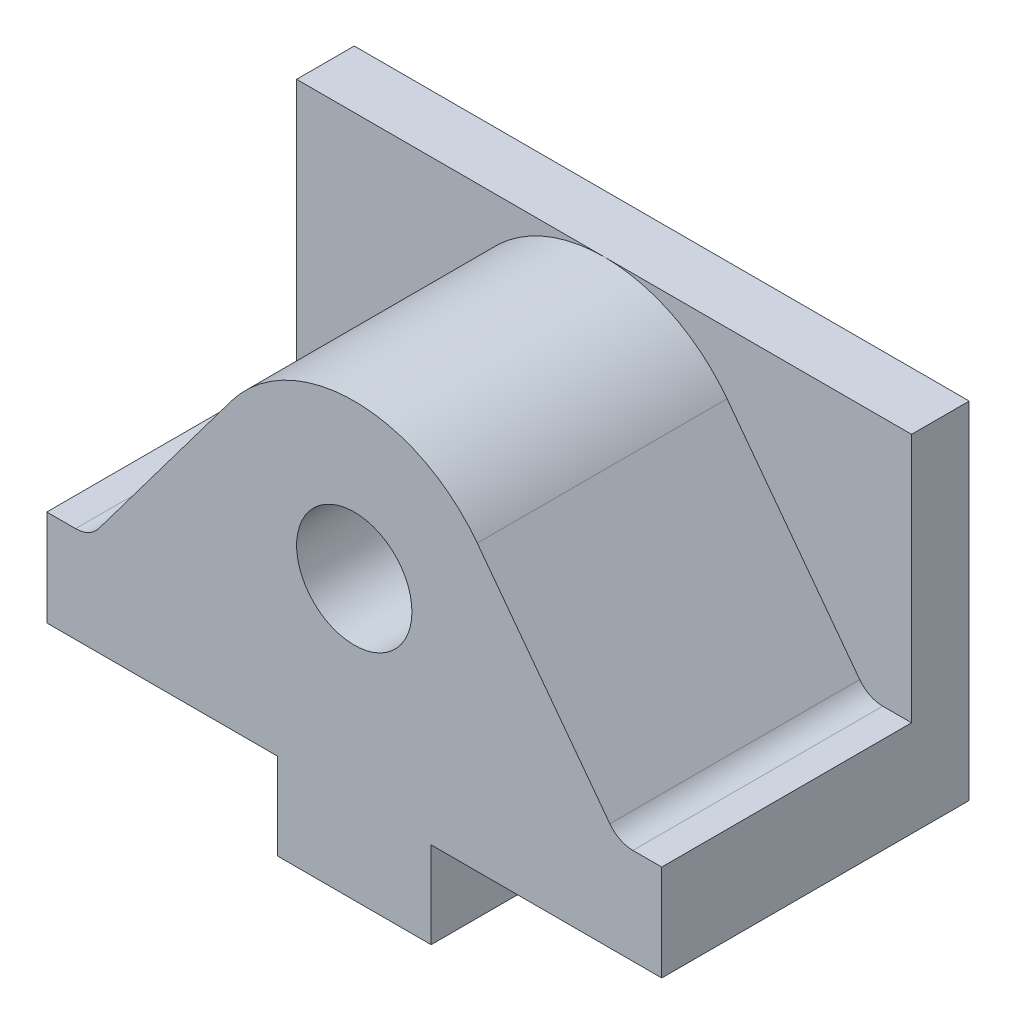
ISO-10303-21;
HEADER;
FILE_DESCRIPTION(('STEP AP214'),'2;1');
FILE_NAME('part.step','',(''),(''),'','','');
FILE_SCHEMA(('AUTOMOTIVE_DESIGN { 1 0 10303 214 1 1 1 1 }'));
ENDSEC;
DATA;
#1=APPLICATION_CONTEXT('core data for automotive mechanical design processes');
#2=APPLICATION_PROTOCOL_DEFINITION('international standard','automotive_design',2000,#1);
#3=PRODUCT_CONTEXT('',#1,'mechanical');
#4=PRODUCT('Part','Part','',(#3));
#5=PRODUCT_RELATED_PRODUCT_CATEGORY('part','',(#4));
#6=PRODUCT_DEFINITION_FORMATION('','',#4);
#7=PRODUCT_DEFINITION_CONTEXT('part definition',#1,'design');
#8=PRODUCT_DEFINITION('design','',#6,#7);
#9=PRODUCT_DEFINITION_SHAPE('','',#8);
#10=(LENGTH_UNIT() NAMED_UNIT(*) SI_UNIT(.MILLI.,.METRE.));
#11=(NAMED_UNIT(*) PLANE_ANGLE_UNIT() SI_UNIT($,.RADIAN.));
#12=(NAMED_UNIT(*) SI_UNIT($,.STERADIAN.) SOLID_ANGLE_UNIT());
#13=UNCERTAINTY_MEASURE_WITH_UNIT(LENGTH_MEASURE(1.E-05),#10,'distance_accuracy_value','');
#14=(GEOMETRIC_REPRESENTATION_CONTEXT(3) GLOBAL_UNCERTAINTY_ASSIGNED_CONTEXT((#13)) GLOBAL_UNIT_ASSIGNED_CONTEXT((#10,
#11,#12)) REPRESENTATION_CONTEXT('',''));
#15=CARTESIAN_POINT('',(0.,0.,0.));
#16=DIRECTION('',(0.,0.,1.));
#17=DIRECTION('',(1.,0.,0.));
#18=AXIS2_PLACEMENT_3D('',#15,#16,#17);
#19=CARTESIAN_POINT('',(0.,0.,0.));
#20=DIRECTION('',(0.,1.,0.));
#21=DIRECTION('',(0.,0.,1.));
#22=AXIS2_PLACEMENT_3D('',#19,#20,#21);
#23=PLANE('',#22);
#24=DIRECTION('',(0.,0.,1.));
#25=VECTOR('',#24,1.);
#26=CARTESIAN_POINT('',(8.,0.,16.));
#27=LINE('',#26,#25);
#28=CARTESIAN_POINT('',(8.,0.,-16.));
#29=VERTEX_POINT('',#28);
#30=CARTESIAN_POINT('',(8.,0.,16.));
#31=VERTEX_POINT('',#30);
#32=EDGE_CURVE('E126',#29,#31,#27,.T.);
#33=ORIENTED_EDGE('',*,*,#32,.F.);
#34=DIRECTION('',(-1.,0.,0.));
#35=VECTOR('',#34,1.);
#36=CARTESIAN_POINT('',(-32.,0.,-16.));
#37=LINE('',#36,#35);
#38=CARTESIAN_POINT('',(32.,0.,-16.));
#39=VERTEX_POINT('',#38);
#40=EDGE_CURVE('E341',#39,#29,#37,.T.);
#41=ORIENTED_EDGE('',*,*,#40,.F.);
#42=DIRECTION('',(0.,0.,-1.));
#43=VECTOR('',#42,1.);
#44=CARTESIAN_POINT('',(32.,0.,-16.));
#45=LINE('',#44,#43);
#46=CARTESIAN_POINT('',(32.,0.,16.));
#47=VERTEX_POINT('',#46);
#48=EDGE_CURVE('E324',#47,#39,#45,.T.);
#49=ORIENTED_EDGE('',*,*,#48,.F.);
#50=DIRECTION('',(1.,0.,0.));
#51=VECTOR('',#50,1.);
#52=CARTESIAN_POINT('',(-32.,0.,16.));
#53=LINE('',#52,#51);
#54=EDGE_CURVE('E131',#31,#47,#53,.T.);
#55=ORIENTED_EDGE('',*,*,#54,.F.);
#56=EDGE_LOOP('',(#33,#41,#49,#55));
#57=FACE_BOUND('',#56,.T.);
#58=ADVANCED_FACE('F110',(#57),#23,.F.);
#59=DIRECTION('',(0.,0.,-1.));
#60=VECTOR('',#59,1.);
#61=CARTESIAN_POINT('',(-8.,0.,16.));
#62=LINE('',#61,#60);
#63=CARTESIAN_POINT('',(-8.,0.,16.));
#64=VERTEX_POINT('',#63);
#65=CARTESIAN_POINT('',(-8.,0.,-16.));
#66=VERTEX_POINT('',#65);
#67=EDGE_CURVE('E363',#64,#66,#62,.T.);
#68=ORIENTED_EDGE('',*,*,#67,.F.);
#69=CARTESIAN_POINT('',(-32.,0.,16.));
#70=VERTEX_POINT('',#69);
#71=EDGE_CURVE('E250',#70,#64,#53,.T.);
#72=ORIENTED_EDGE('',*,*,#71,.F.);
#73=DIRECTION('',(0.,0.,1.));
#74=VECTOR('',#73,1.);
#75=CARTESIAN_POINT('',(-32.,0.,-16.));
#76=LINE('',#75,#74);
#77=CARTESIAN_POINT('',(-32.,0.,-16.));
#78=VERTEX_POINT('',#77);
#79=EDGE_CURVE('E343',#78,#70,#76,.T.);
#80=ORIENTED_EDGE('',*,*,#79,.F.);
#81=EDGE_CURVE('E340',#66,#78,#37,.T.);
#82=ORIENTED_EDGE('',*,*,#81,.F.);
#83=EDGE_LOOP('',(#68,#72,#80,#82));
#84=FACE_BOUND('',#83,.T.);
#85=ADVANCED_FACE('F362',(#84),#23,.F.);
#86=CARTESIAN_POINT('',(0.,36.,0.));
#87=DIRECTION('',(0.,1.,0.));
#88=DIRECTION('',(0.,0.,1.));
#89=AXIS2_PLACEMENT_3D('',#86,#87,#88);
#90=PLANE('',#89);
#91=DIRECTION('',(-1.,0.,0.));
#92=VECTOR('',#91,1.);
#93=CARTESIAN_POINT('',(0.,36.,-10.));
#94=LINE('',#93,#92);
#95=CARTESIAN_POINT('',(0.,36.,-10.));
#96=VERTEX_POINT('',#95);
#97=CARTESIAN_POINT('',(-32.,36.,-10.));
#98=VERTEX_POINT('',#97);
#99=EDGE_CURVE('E306',#96,#98,#94,.T.);
#100=ORIENTED_EDGE('',*,*,#99,.F.);
#101=DIRECTION('',(-1.,0.,0.));
#102=VECTOR('',#101,1.);
#103=CARTESIAN_POINT('',(0.,36.,-10.));
#104=LINE('',#103,#102);
#105=CARTESIAN_POINT('',(32.,36.,-10.));
#106=VERTEX_POINT('',#105);
#107=EDGE_CURVE('E266',#106,#96,#104,.T.);
#108=ORIENTED_EDGE('',*,*,#107,.F.);
#109=DIRECTION('',(0.,0.,-1.));
#110=VECTOR('',#109,1.);
#111=CARTESIAN_POINT('',(32.,36.,-16.));
#112=LINE('',#111,#110);
#113=CARTESIAN_POINT('',(32.,36.,-16.));
#114=VERTEX_POINT('',#113);
#115=EDGE_CURVE('E330',#106,#114,#112,.T.);
#116=ORIENTED_EDGE('',*,*,#115,.T.);
#117=DIRECTION('',(-1.,0.,0.));
#118=VECTOR('',#117,1.);
#119=CARTESIAN_POINT('',(-32.,36.,-16.));
#120=LINE('',#119,#118);
#121=CARTESIAN_POINT('',(-32.,36.,-16.));
#122=VERTEX_POINT('',#121);
#123=EDGE_CURVE('E332',#114,#122,#120,.T.);
#124=ORIENTED_EDGE('',*,*,#123,.T.);
#125=DIRECTION('',(0.,0.,1.));
#126=VECTOR('',#125,1.);
#127=CARTESIAN_POINT('',(-32.,36.,-16.));
#128=LINE('',#127,#126);
#129=EDGE_CURVE('E334',#122,#98,#128,.T.);
#130=ORIENTED_EDGE('',*,*,#129,.T.);
#131=EDGE_LOOP('',(#100,#108,#116,#124,#130));
#132=FACE_BOUND('',#131,.T.);
#133=ADVANCED_FACE('F414',(#132),#90,.T.);
#134=CARTESIAN_POINT('',(32.,36.,-16.));
#135=DIRECTION('',(-1.,0.,0.));
#136=DIRECTION('',(0.,0.,1.));
#137=AXIS2_PLACEMENT_3D('',#134,#135,#136);
#138=PLANE('',#137);
#139=DIRECTION('',(0.,0.,1.));
#140=VECTOR('',#139,1.);
#141=CARTESIAN_POINT('',(32.,10.,-10.));
#142=LINE('',#141,#140);
#143=CARTESIAN_POINT('',(32.,10.,-10.));
#144=VERTEX_POINT('',#143);
#145=CARTESIAN_POINT('',(32.,10.,16.));
#146=VERTEX_POINT('',#145);
#147=EDGE_CURVE('E287',#144,#146,#142,.T.);
#148=ORIENTED_EDGE('',*,*,#147,.T.);
#149=DIRECTION('',(0.,-1.,0.));
#150=VECTOR('',#149,1.);
#151=CARTESIAN_POINT('',(32.,36.,16.));
#152=LINE('',#151,#150);
#153=EDGE_CURVE('E337',#146,#47,#152,.T.);
#154=ORIENTED_EDGE('',*,*,#153,.T.);
#155=ORIENTED_EDGE('',*,*,#48,.T.);
#156=DIRECTION('',(0.,-1.,0.));
#157=VECTOR('',#156,1.);
#158=CARTESIAN_POINT('',(32.,36.,-16.));
#159=LINE('',#158,#157);
#160=EDGE_CURVE('E12',#114,#39,#159,.T.);
#161=ORIENTED_EDGE('',*,*,#160,.F.);
#162=ORIENTED_EDGE('',*,*,#115,.F.);
#163=DIRECTION('',(0.,1.,0.));
#164=VECTOR('',#163,1.);
#165=CARTESIAN_POINT('',(32.,0.,-10.));
#166=LINE('',#165,#164);
#167=EDGE_CURVE('E264',#144,#106,#166,.T.);
#168=ORIENTED_EDGE('',*,*,#167,.F.);
#169=EDGE_LOOP('',(#148,#154,#155,#161,#162,#168));
#170=FACE_BOUND('',#169,.T.);
#171=ADVANCED_FACE('F112',(#170),#138,.F.);
#172=CARTESIAN_POINT('',(-32.,36.,16.));
#173=DIRECTION('',(0.,0.,-1.));
#174=DIRECTION('',(-1.,0.,0.));
#175=AXIS2_PLACEMENT_3D('',#172,#173,#174);
#176=PLANE('',#175);
#177=CARTESIAN_POINT('',(0.,20.,16.));
#178=DIRECTION('',(0.,0.,1.));
#179=DIRECTION('',(1.,0.,0.));
#180=AXIS2_PLACEMENT_3D('',#177,#178,#179);
#181=CIRCLE('',#180,6.);
#182=CARTESIAN_POINT('',(6.,20.,16.));
#183=VERTEX_POINT('',#182);
#184=EDGE_CURVE('E283',#183,#183,#181,.T.);
#185=ORIENTED_EDGE('',*,*,#184,.F.);
#186=EDGE_LOOP('',(#185));
#187=FACE_BOUND('',#186,.T.);
#188=DIRECTION('',(-0.6,0.8,0.));
#189=VECTOR('',#188,1.);
#190=CARTESIAN_POINT('',(22.4,16.8,16.));
#191=LINE('',#190,#189);
#192=CARTESIAN_POINT('',(26.6,11.2,16.));
#193=VERTEX_POINT('',#192);
#194=CARTESIAN_POINT('',(12.8,29.6,16.));
#195=VERTEX_POINT('',#194);
#196=EDGE_CURVE('E262',#193,#195,#191,.T.);
#197=ORIENTED_EDGE('',*,*,#196,.T.);
#198=CARTESIAN_POINT('',(0.,20.,16.));
#199=DIRECTION('',(0.,0.,1.));
#200=DIRECTION('',(1.,0.,0.));
#201=AXIS2_PLACEMENT_3D('',#198,#199,#200);
#202=CIRCLE('',#201,16.);
#203=CARTESIAN_POINT('',(-12.8,29.6,16.));
#204=VERTEX_POINT('',#203);
#205=EDGE_CURVE('E298',#195,#204,#202,.T.);
#206=ORIENTED_EDGE('',*,*,#205,.T.);
#207=DIRECTION('',(0.6,0.8,0.));
#208=VECTOR('',#207,1.);
#209=CARTESIAN_POINT('',(-22.4,16.8,16.));
#210=LINE('',#209,#208);
#211=CARTESIAN_POINT('',(-26.6,11.2,16.));
#212=VERTEX_POINT('',#211);
#213=EDGE_CURVE('E317',#212,#204,#210,.T.);
#214=ORIENTED_EDGE('',*,*,#213,.F.);
#215=CARTESIAN_POINT('',(-29.,13.,16.));
#216=DIRECTION('',(0.,0.,1.));
#217=DIRECTION('',(1.,0.,0.));
#218=AXIS2_PLACEMENT_3D('',#215,#216,#217);
#219=CIRCLE('',#218,3.);
#220=CARTESIAN_POINT('',(-29.,10.,16.));
#221=VERTEX_POINT('',#220);
#222=EDGE_CURVE('E314',#221,#212,#219,.T.);
#223=ORIENTED_EDGE('',*,*,#222,.F.);
#224=DIRECTION('',(1.,0.,0.));
#225=VECTOR('',#224,1.);
#226=CARTESIAN_POINT('',(0.,10.,16.));
#227=LINE('',#226,#225);
#228=CARTESIAN_POINT('',(-32.,10.,16.));
#229=VERTEX_POINT('',#228);
#230=EDGE_CURVE('E293',#229,#221,#227,.T.);
#231=ORIENTED_EDGE('',*,*,#230,.F.);
#232=DIRECTION('',(0.,-1.,0.));
#233=VECTOR('',#232,1.);
#234=CARTESIAN_POINT('',(-32.,36.,16.));
#235=LINE('',#234,#233);
#236=EDGE_CURVE('E349',#229,#70,#235,.T.);
#237=ORIENTED_EDGE('',*,*,#236,.T.);
#238=ORIENTED_EDGE('',*,*,#71,.T.);
#239=DIRECTION('',(0.,1.,0.));
#240=VECTOR('',#239,1.);
#241=CARTESIAN_POINT('',(-8.,-9.,16.));
#242=LINE('',#241,#240);
#243=CARTESIAN_POINT('',(-8.,-9.,16.));
#244=VERTEX_POINT('',#243);
#245=EDGE_CURVE('E230',#244,#64,#242,.T.);
#246=ORIENTED_EDGE('',*,*,#245,.F.);
#247=DIRECTION('',(-1.,0.,0.));
#248=VECTOR('',#247,1.);
#249=CARTESIAN_POINT('',(-8.,-9.,16.));
#250=LINE('',#249,#248);
#251=CARTESIAN_POINT('',(8.,-9.,16.));
#252=VERTEX_POINT('',#251);
#253=EDGE_CURVE('E236',#252,#244,#250,.T.);
#254=ORIENTED_EDGE('',*,*,#253,.F.);
#255=DIRECTION('',(0.,1.,0.));
#256=VECTOR('',#255,1.);
#257=CARTESIAN_POINT('',(8.,-9.,16.));
#258=LINE('',#257,#256);
#259=EDGE_CURVE('E369',#252,#31,#258,.T.);
#260=ORIENTED_EDGE('',*,*,#259,.T.);
#261=ORIENTED_EDGE('',*,*,#54,.T.);
#262=ORIENTED_EDGE('',*,*,#153,.F.);
#263=DIRECTION('',(-1.,0.,0.));
#264=VECTOR('',#263,1.);
#265=CARTESIAN_POINT('',(0.,10.,16.));
#266=LINE('',#265,#264);
#267=CARTESIAN_POINT('',(29.,10.,16.));
#268=VERTEX_POINT('',#267);
#269=EDGE_CURVE('E276',#146,#268,#266,.T.);
#270=ORIENTED_EDGE('',*,*,#269,.T.);
#271=CARTESIAN_POINT('',(29.,13.,16.));
#272=DIRECTION('',(0.,0.,1.));
#273=DIRECTION('',(1.,0.,0.));
#274=AXIS2_PLACEMENT_3D('',#271,#272,#273);
#275=CIRCLE('',#274,3.);
#276=EDGE_CURVE('E253',#268,#193,#275,.F.);
#277=ORIENTED_EDGE('',*,*,#276,.T.);
#278=EDGE_LOOP('',(#197,#206,#214,#223,#231,#237,#238,#246,#254,#260,#261,#262,#270,#277));
#279=FACE_BOUND('',#278,.T.);
#280=ADVANCED_FACE('F248',(#187,#279),#176,.F.);
#281=CARTESIAN_POINT('',(-32.,36.,-16.));
#282=DIRECTION('',(0.,0.,1.));
#283=DIRECTION('',(1.,0.,0.));
#284=AXIS2_PLACEMENT_3D('',#281,#282,#283);
#285=PLANE('',#284);
#286=CARTESIAN_POINT('',(0.,20.,-16.));
#287=DIRECTION('',(0.,0.,1.));
#288=DIRECTION('',(1.,0.,0.));
#289=AXIS2_PLACEMENT_3D('',#286,#287,#288);
#290=CIRCLE('',#289,6.);
#291=CARTESIAN_POINT('',(6.,20.,-16.));
#292=VERTEX_POINT('',#291);
#293=EDGE_CURVE('E114',#292,#292,#290,.T.);
#294=ORIENTED_EDGE('',*,*,#293,.T.);
#295=EDGE_LOOP('',(#294));
#296=FACE_BOUND('',#295,.T.);
#297=ORIENTED_EDGE('',*,*,#40,.T.);
#298=DIRECTION('',(0.,1.,0.));
#299=VECTOR('',#298,1.);
#300=CARTESIAN_POINT('',(8.,-9.,-16.));
#301=LINE('',#300,#299);
#302=CARTESIAN_POINT('',(8.,-9.,-16.));
#303=VERTEX_POINT('',#302);
#304=EDGE_CURVE('E254',#303,#29,#301,.T.);
#305=ORIENTED_EDGE('',*,*,#304,.F.);
#306=DIRECTION('',(1.,0.,0.));
#307=VECTOR('',#306,1.);
#308=CARTESIAN_POINT('',(-8.,-9.,-16.));
#309=LINE('',#308,#307);
#310=CARTESIAN_POINT('',(-8.,-9.,-16.));
#311=VERTEX_POINT('',#310);
#312=EDGE_CURVE('E235',#311,#303,#309,.T.);
#313=ORIENTED_EDGE('',*,*,#312,.F.);
#314=DIRECTION('',(0.,1.,0.));
#315=VECTOR('',#314,1.);
#316=CARTESIAN_POINT('',(-8.,-9.,-16.));
#317=LINE('',#316,#315);
#318=EDGE_CURVE('E232',#311,#66,#317,.T.);
#319=ORIENTED_EDGE('',*,*,#318,.T.);
#320=ORIENTED_EDGE('',*,*,#81,.T.);
#321=DIRECTION('',(0.,-1.,0.));
#322=VECTOR('',#321,1.);
#323=CARTESIAN_POINT('',(-32.,36.,-16.));
#324=LINE('',#323,#322);
#325=EDGE_CURVE('E119',#122,#78,#324,.T.);
#326=ORIENTED_EDGE('',*,*,#325,.F.);
#327=ORIENTED_EDGE('',*,*,#123,.F.);
#328=ORIENTED_EDGE('',*,*,#160,.T.);
#329=EDGE_LOOP('',(#297,#305,#313,#319,#320,#326,#327,#328));
#330=FACE_BOUND('',#329,.T.);
#331=ADVANCED_FACE('F374',(#296,#330),#285,.F.);
#332=CARTESIAN_POINT('',(-32.,36.,-16.));
#333=DIRECTION('',(1.,0.,0.));
#334=DIRECTION('',(0.,0.,-1.));
#335=AXIS2_PLACEMENT_3D('',#332,#333,#334);
#336=PLANE('',#335);
#337=ORIENTED_EDGE('',*,*,#236,.F.);
#338=DIRECTION('',(0.,0.,1.));
#339=VECTOR('',#338,1.);
#340=CARTESIAN_POINT('',(-32.,10.,-10.));
#341=LINE('',#340,#339);
#342=CARTESIAN_POINT('',(-32.,10.,-10.));
#343=VERTEX_POINT('',#342);
#344=EDGE_CURVE('E322',#343,#229,#341,.T.);
#345=ORIENTED_EDGE('',*,*,#344,.F.);
#346=DIRECTION('',(0.,-1.,0.));
#347=VECTOR('',#346,1.);
#348=CARTESIAN_POINT('',(-32.,0.,-10.));
#349=LINE('',#348,#347);
#350=EDGE_CURVE('E308',#98,#343,#349,.T.);
#351=ORIENTED_EDGE('',*,*,#350,.F.);
#352=ORIENTED_EDGE('',*,*,#129,.F.);
#353=ORIENTED_EDGE('',*,*,#325,.T.);
#354=ORIENTED_EDGE('',*,*,#79,.T.);
#355=EDGE_LOOP('',(#337,#345,#351,#352,#353,#354));
#356=FACE_BOUND('',#355,.T.);
#357=ADVANCED_FACE('F357',(#356),#336,.F.);
#358=CARTESIAN_POINT('',(0.,10.,-10.));
#359=DIRECTION('',(0.,-1.,0.));
#360=DIRECTION('',(0.,0.,-1.));
#361=AXIS2_PLACEMENT_3D('',#358,#359,#360);
#362=PLANE('',#361);
#363=ORIENTED_EDGE('',*,*,#230,.T.);
#364=DIRECTION('',(0.,0.,1.));
#365=VECTOR('',#364,1.);
#366=CARTESIAN_POINT('',(-29.,10.,-10.));
#367=LINE('',#366,#365);
#368=CARTESIAN_POINT('',(-29.,10.,-10.));
#369=VERTEX_POINT('',#368);
#370=EDGE_CURVE('E311',#369,#221,#367,.T.);
#371=ORIENTED_EDGE('',*,*,#370,.F.);
#372=DIRECTION('',(1.,0.,0.));
#373=VECTOR('',#372,1.);
#374=CARTESIAN_POINT('',(0.,10.,-10.));
#375=LINE('',#374,#373);
#376=EDGE_CURVE('E294',#343,#369,#375,.T.);
#377=ORIENTED_EDGE('',*,*,#376,.F.);
#378=ORIENTED_EDGE('',*,*,#344,.T.);
#379=EDGE_LOOP('',(#363,#371,#377,#378));
#380=FACE_BOUND('',#379,.T.);
#381=ADVANCED_FACE('F408',(#380),#362,.F.);
#382=CARTESIAN_POINT('',(0.,20.,-10.));
#383=DIRECTION('',(0.,0.,1.));
#384=DIRECTION('',(1.,0.,0.));
#385=AXIS2_PLACEMENT_3D('',#382,#383,#384);
#386=CYLINDRICAL_SURFACE('',#385,16.);
#387=ORIENTED_EDGE('',*,*,#205,.F.);
#388=DIRECTION('',(0.,0.,1.));
#389=VECTOR('',#388,1.);
#390=CARTESIAN_POINT('',(12.8,29.6,-10.));
#391=LINE('',#390,#389);
#392=CARTESIAN_POINT('',(12.8,29.6,-10.));
#393=VERTEX_POINT('',#392);
#394=EDGE_CURVE('E284',#393,#195,#391,.T.);
#395=ORIENTED_EDGE('',*,*,#394,.F.);
#396=CARTESIAN_POINT('',(0.,20.,-10.));
#397=DIRECTION('',(0.,0.,1.));
#398=DIRECTION('',(1.,0.,0.));
#399=AXIS2_PLACEMENT_3D('',#396,#397,#398);
#400=CIRCLE('',#399,16.);
#401=EDGE_CURVE('E268',#393,#96,#400,.T.);
#402=ORIENTED_EDGE('',*,*,#401,.T.);
#403=CARTESIAN_POINT('',(0.,20.,-10.));
#404=DIRECTION('',(0.,0.,1.));
#405=DIRECTION('',(1.,0.,0.));
#406=AXIS2_PLACEMENT_3D('',#403,#404,#405);
#407=CIRCLE('',#406,16.);
#408=CARTESIAN_POINT('',(-12.8,29.6,-10.));
#409=VERTEX_POINT('',#408);
#410=EDGE_CURVE('E304',#96,#409,#407,.T.);
#411=ORIENTED_EDGE('',*,*,#410,.T.);
#412=DIRECTION('',(0.,0.,1.));
#413=VECTOR('',#412,1.);
#414=CARTESIAN_POINT('',(-12.8,29.6,-10.));
#415=LINE('',#414,#413);
#416=EDGE_CURVE('E325',#409,#204,#415,.T.);
#417=ORIENTED_EDGE('',*,*,#416,.T.);
#418=EDGE_LOOP('',(#387,#395,#402,#411,#417));
#419=FACE_BOUND('',#418,.T.);
#420=ADVANCED_FACE('F395',(#419),#386,.T.);
#421=CARTESIAN_POINT('',(-22.4,16.8,-10.));
#422=DIRECTION('',(0.8,-0.6,0.));
#423=DIRECTION('',(0.6,0.8,0.));
#424=AXIS2_PLACEMENT_3D('',#421,#422,#423);
#425=PLANE('',#424);
#426=ORIENTED_EDGE('',*,*,#213,.T.);
#427=ORIENTED_EDGE('',*,*,#416,.F.);
#428=DIRECTION('',(0.6,0.8,0.));
#429=VECTOR('',#428,1.);
#430=CARTESIAN_POINT('',(-22.4,16.8,-10.));
#431=LINE('',#430,#429);
#432=CARTESIAN_POINT('',(-26.6,11.2,-10.));
#433=VERTEX_POINT('',#432);
#434=EDGE_CURVE('E301',#433,#409,#431,.T.);
#435=ORIENTED_EDGE('',*,*,#434,.F.);
#436=DIRECTION('',(0.,0.,1.));
#437=VECTOR('',#436,1.);
#438=CARTESIAN_POINT('',(-26.6,11.2,-10.));
#439=LINE('',#438,#437);
#440=EDGE_CURVE('E327',#433,#212,#439,.T.);
#441=ORIENTED_EDGE('',*,*,#440,.T.);
#442=EDGE_LOOP('',(#426,#427,#435,#441));
#443=FACE_BOUND('',#442,.T.);
#444=ADVANCED_FACE('F401',(#443),#425,.F.);
#445=CARTESIAN_POINT('',(-29.,13.,-10.));
#446=DIRECTION('',(0.,0.,1.));
#447=DIRECTION('',(1.,0.,0.));
#448=AXIS2_PLACEMENT_3D('',#445,#446,#447);
#449=CYLINDRICAL_SURFACE('',#448,3.);
#450=ORIENTED_EDGE('',*,*,#222,.T.);
#451=ORIENTED_EDGE('',*,*,#440,.F.);
#452=CARTESIAN_POINT('',(-29.,13.,-10.));
#453=DIRECTION('',(0.,0.,1.));
#454=DIRECTION('',(1.,0.,0.));
#455=AXIS2_PLACEMENT_3D('',#452,#453,#454);
#456=CIRCLE('',#455,3.);
#457=EDGE_CURVE('E297',#369,#433,#456,.T.);
#458=ORIENTED_EDGE('',*,*,#457,.F.);
#459=ORIENTED_EDGE('',*,*,#370,.T.);
#460=EDGE_LOOP('',(#450,#451,#458,#459));
#461=FACE_BOUND('',#460,.T.);
#462=ADVANCED_FACE('F404',(#461),#449,.F.);
#463=CARTESIAN_POINT('',(0.,0.,-10.));
#464=DIRECTION('',(0.,0.,1.));
#465=DIRECTION('',(1.,0.,0.));
#466=AXIS2_PLACEMENT_3D('',#463,#464,#465);
#467=PLANE('',#466);
#468=ORIENTED_EDGE('',*,*,#376,.T.);
#469=ORIENTED_EDGE('',*,*,#457,.T.);
#470=ORIENTED_EDGE('',*,*,#434,.T.);
#471=ORIENTED_EDGE('',*,*,#410,.F.);
#472=ORIENTED_EDGE('',*,*,#99,.T.);
#473=ORIENTED_EDGE('',*,*,#350,.T.);
#474=EDGE_LOOP('',(#468,#469,#470,#471,#472,#473));
#475=FACE_BOUND('',#474,.T.);
#476=ADVANCED_FACE('F410',(#475),#467,.T.);
#477=CARTESIAN_POINT('',(29.,13.,-10.));
#478=DIRECTION('',(0.,0.,1.));
#479=DIRECTION('',(1.,0.,0.));
#480=AXIS2_PLACEMENT_3D('',#477,#478,#479);
#481=CYLINDRICAL_SURFACE('',#480,3.);
#482=ORIENTED_EDGE('',*,*,#276,.F.);
#483=DIRECTION('',(0.,0.,1.));
#484=VECTOR('',#483,1.);
#485=CARTESIAN_POINT('',(29.,10.,-10.));
#486=LINE('',#485,#484);
#487=CARTESIAN_POINT('',(29.,10.,-10.));
#488=VERTEX_POINT('',#487);
#489=EDGE_CURVE('E273',#488,#268,#486,.T.);
#490=ORIENTED_EDGE('',*,*,#489,.F.);
#491=CARTESIAN_POINT('',(29.,13.,-10.));
#492=DIRECTION('',(0.,0.,1.));
#493=DIRECTION('',(1.,0.,0.));
#494=AXIS2_PLACEMENT_3D('',#491,#492,#493);
#495=CIRCLE('',#494,3.);
#496=CARTESIAN_POINT('',(26.6,11.2,-10.));
#497=VERTEX_POINT('',#496);
#498=EDGE_CURVE('E258',#488,#497,#495,.F.);
#499=ORIENTED_EDGE('',*,*,#498,.T.);
#500=DIRECTION('',(0.,0.,1.));
#501=VECTOR('',#500,1.);
#502=CARTESIAN_POINT('',(26.6,11.2,-10.));
#503=LINE('',#502,#501);
#504=EDGE_CURVE('E280',#497,#193,#503,.T.);
#505=ORIENTED_EDGE('',*,*,#504,.T.);
#506=EDGE_LOOP('',(#482,#490,#499,#505));
#507=FACE_BOUND('',#506,.T.);
#508=ADVANCED_FACE('F387',(#507),#481,.F.);
#509=CARTESIAN_POINT('',(22.4,16.8,-10.));
#510=DIRECTION('',(0.8,0.6,0.));
#511=DIRECTION('',(-0.6,0.8,0.));
#512=AXIS2_PLACEMENT_3D('',#509,#510,#511);
#513=PLANE('',#512);
#514=ORIENTED_EDGE('',*,*,#196,.F.);
#515=ORIENTED_EDGE('',*,*,#504,.F.);
#516=DIRECTION('',(-0.6,0.8,0.));
#517=VECTOR('',#516,1.);
#518=CARTESIAN_POINT('',(22.4,16.8,-10.));
#519=LINE('',#518,#517);
#520=EDGE_CURVE('E271',#497,#393,#519,.T.);
#521=ORIENTED_EDGE('',*,*,#520,.T.);
#522=ORIENTED_EDGE('',*,*,#394,.T.);
#523=EDGE_LOOP('',(#514,#515,#521,#522));
#524=FACE_BOUND('',#523,.T.);
#525=ADVANCED_FACE('F390',(#524),#513,.T.);
#526=CARTESIAN_POINT('',(0.,10.,-10.));
#527=DIRECTION('',(0.,1.,0.));
#528=DIRECTION('',(0.,0.,1.));
#529=AXIS2_PLACEMENT_3D('',#526,#527,#528);
#530=PLANE('',#529);
#531=ORIENTED_EDGE('',*,*,#269,.F.);
#532=ORIENTED_EDGE('',*,*,#147,.F.);
#533=DIRECTION('',(-1.,0.,0.));
#534=VECTOR('',#533,1.);
#535=CARTESIAN_POINT('',(0.,10.,-10.));
#536=LINE('',#535,#534);
#537=EDGE_CURVE('E261',#144,#488,#536,.T.);
#538=ORIENTED_EDGE('',*,*,#537,.T.);
#539=ORIENTED_EDGE('',*,*,#489,.T.);
#540=EDGE_LOOP('',(#531,#532,#538,#539));
#541=FACE_BOUND('',#540,.T.);
#542=ADVANCED_FACE('F382',(#541),#530,.T.);
#543=CARTESIAN_POINT('',(0.,0.,-10.));
#544=DIRECTION('',(0.,0.,1.));
#545=DIRECTION('',(1.,0.,0.));
#546=AXIS2_PLACEMENT_3D('',#543,#544,#545);
#547=PLANE('',#546);
#548=ORIENTED_EDGE('',*,*,#498,.F.);
#549=ORIENTED_EDGE('',*,*,#537,.F.);
#550=ORIENTED_EDGE('',*,*,#167,.T.);
#551=ORIENTED_EDGE('',*,*,#107,.T.);
#552=ORIENTED_EDGE('',*,*,#401,.F.);
#553=ORIENTED_EDGE('',*,*,#520,.F.);
#554=EDGE_LOOP('',(#548,#549,#550,#551,#552,#553));
#555=FACE_BOUND('',#554,.T.);
#556=ADVANCED_FACE('F416',(#555),#547,.T.);
#557=CARTESIAN_POINT('',(0.,20.,-10.));
#558=DIRECTION('',(0.,0.,1.));
#559=DIRECTION('',(1.,0.,0.));
#560=AXIS2_PLACEMENT_3D('',#557,#558,#559);
#561=CYLINDRICAL_SURFACE('',#560,6.);
#562=ORIENTED_EDGE('',*,*,#184,.T.);
#563=EDGE_LOOP('',(#562));
#564=FACE_BOUND('',#563,.T.);
#565=ORIENTED_EDGE('',*,*,#293,.F.);
#566=EDGE_LOOP('',(#565));
#567=FACE_BOUND('',#566,.T.);
#568=ADVANCED_FACE('F418',(#564,#567),#561,.F.);
#569=CARTESIAN_POINT('',(-8.,-9.,16.));
#570=DIRECTION('',(1.,0.,0.));
#571=DIRECTION('',(0.,0.,-1.));
#572=AXIS2_PLACEMENT_3D('',#569,#570,#571);
#573=PLANE('',#572);
#574=ORIENTED_EDGE('',*,*,#67,.T.);
#575=ORIENTED_EDGE('',*,*,#318,.F.);
#576=DIRECTION('',(0.,0.,-1.));
#577=VECTOR('',#576,1.);
#578=CARTESIAN_POINT('',(-8.,-9.,16.));
#579=LINE('',#578,#577);
#580=EDGE_CURVE('E225',#244,#311,#579,.T.);
#581=ORIENTED_EDGE('',*,*,#580,.F.);
#582=ORIENTED_EDGE('',*,*,#245,.T.);
#583=EDGE_LOOP('',(#574,#575,#581,#582));
#584=FACE_BOUND('',#583,.T.);
#585=ADVANCED_FACE('F228',(#584),#573,.F.);
#586=CARTESIAN_POINT('',(8.,-9.,16.));
#587=DIRECTION('',(-1.,0.,0.));
#588=DIRECTION('',(0.,0.,1.));
#589=AXIS2_PLACEMENT_3D('',#586,#587,#588);
#590=PLANE('',#589);
#591=ORIENTED_EDGE('',*,*,#32,.T.);
#592=ORIENTED_EDGE('',*,*,#259,.F.);
#593=DIRECTION('',(0.,0.,1.));
#594=VECTOR('',#593,1.);
#595=CARTESIAN_POINT('',(8.,-9.,16.));
#596=LINE('',#595,#594);
#597=EDGE_CURVE('E241',#303,#252,#596,.T.);
#598=ORIENTED_EDGE('',*,*,#597,.F.);
#599=ORIENTED_EDGE('',*,*,#304,.T.);
#600=EDGE_LOOP('',(#591,#592,#598,#599));
#601=FACE_BOUND('',#600,.T.);
#602=ADVANCED_FACE('F373',(#601),#590,.F.);
#603=CARTESIAN_POINT('',(0.,-9.,0.));
#604=DIRECTION('',(0.,1.,0.));
#605=DIRECTION('',(0.,0.,1.));
#606=AXIS2_PLACEMENT_3D('',#603,#604,#605);
#607=PLANE('',#606);
#608=ORIENTED_EDGE('',*,*,#253,.T.);
#609=ORIENTED_EDGE('',*,*,#580,.T.);
#610=ORIENTED_EDGE('',*,*,#312,.T.);
#611=ORIENTED_EDGE('',*,*,#597,.T.);
#612=EDGE_LOOP('',(#608,#609,#610,#611));
#613=FACE_BOUND('',#612,.T.);
#614=ADVANCED_FACE('F239',(#613),#607,.F.);
#615=CLOSED_SHELL('',(#58,#85,#133,#171,#280,#331,#357,#381,#420,#444,#462,#476,#508,#525,#542,
#556,#568,#585,#602,#614));
#616=MANIFOLD_SOLID_BREP('B2',#615);
#617=ADVANCED_BREP_SHAPE_REPRESENTATION('',(#18,#616),#14);
#618=SHAPE_DEFINITION_REPRESENTATION(#9,#617);
ENDSEC;
END-ISO-10303-21;
